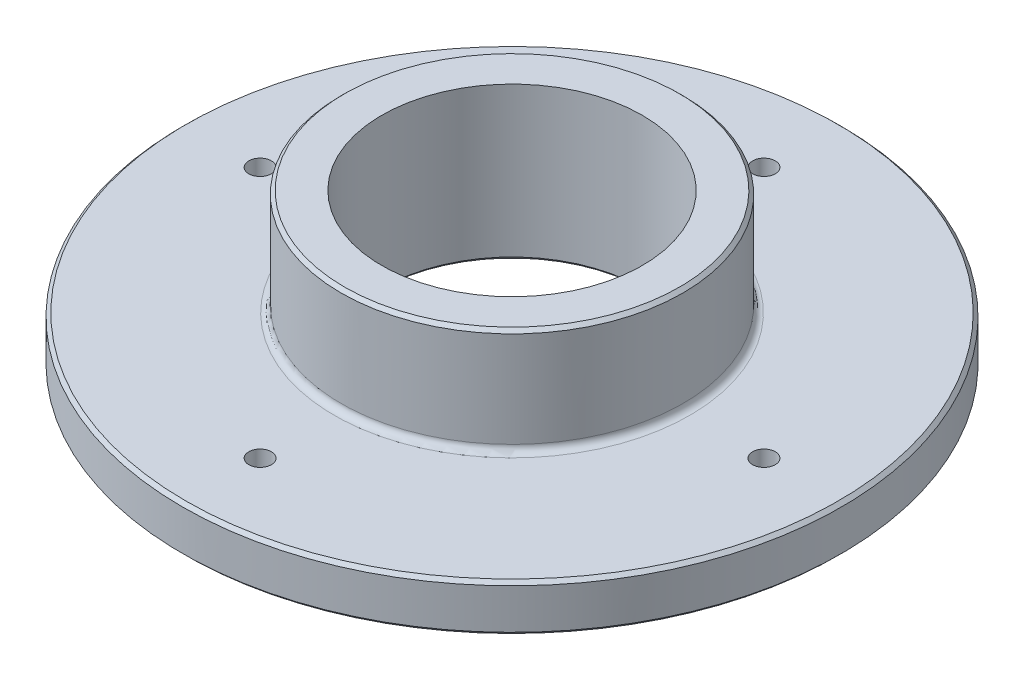
ISO-10303-21;
HEADER;
FILE_DESCRIPTION(('STEP AP214'),'2;1');
FILE_NAME('part.step','',(''),(''),'','','');
FILE_SCHEMA(('AUTOMOTIVE_DESIGN { 1 0 10303 214 1 1 1 1 }'));
ENDSEC;
DATA;
#1=APPLICATION_CONTEXT('core data for automotive mechanical design processes');
#2=APPLICATION_PROTOCOL_DEFINITION('international standard','automotive_design',2000,#1);
#3=PRODUCT_CONTEXT('',#1,'mechanical');
#4=PRODUCT('Part','Part','',(#3));
#5=PRODUCT_RELATED_PRODUCT_CATEGORY('part','',(#4));
#6=PRODUCT_DEFINITION_FORMATION('','',#4);
#7=PRODUCT_DEFINITION_CONTEXT('part definition',#1,'design');
#8=PRODUCT_DEFINITION('design','',#6,#7);
#9=PRODUCT_DEFINITION_SHAPE('','',#8);
#10=(LENGTH_UNIT() NAMED_UNIT(*) SI_UNIT(.MILLI.,.METRE.));
#11=(NAMED_UNIT(*) PLANE_ANGLE_UNIT() SI_UNIT($,.RADIAN.));
#12=(NAMED_UNIT(*) SI_UNIT($,.STERADIAN.) SOLID_ANGLE_UNIT());
#13=UNCERTAINTY_MEASURE_WITH_UNIT(LENGTH_MEASURE(1.E-05),#10,'distance_accuracy_value','');
#14=(GEOMETRIC_REPRESENTATION_CONTEXT(3) GLOBAL_UNCERTAINTY_ASSIGNED_CONTEXT((#13)) GLOBAL_UNIT_ASSIGNED_CONTEXT((#10,
#11,#12)) REPRESENTATION_CONTEXT('',''));
#15=CARTESIAN_POINT('',(0.,0.,0.));
#16=DIRECTION('',(0.,0.,1.));
#17=DIRECTION('',(1.,0.,0.));
#18=AXIS2_PLACEMENT_3D('',#15,#16,#17);
#19=CARTESIAN_POINT('',(38.1,0.,0.));
#20=DIRECTION('',(0.,-1.,0.));
#21=DIRECTION('',(0.,0.,-1.));
#22=AXIS2_PLACEMENT_3D('',#19,#20,#21);
#23=PLANE('',#22);
#24=CARTESIAN_POINT('',(73.7,0.,0.));
#25=DIRECTION('',(0.,-1.,0.));
#26=DIRECTION('',(0.,0.,-1.));
#27=AXIS2_PLACEMENT_3D('',#24,#25,#26);
#28=CIRCLE('',#27,3.29999999999999);
#29=CARTESIAN_POINT('',(73.7,0.,-3.29999999999999));
#30=VERTEX_POINT('',#29);
#31=EDGE_CURVE('E90',#30,#30,#28,.T.);
#32=ORIENTED_EDGE('',*,*,#31,.F.);
#33=EDGE_LOOP('',(#32));
#34=FACE_BOUND('',#33,.T.);
#35=CARTESIAN_POINT('',(0.,0.,73.7));
#36=DIRECTION('',(0.,-1.,0.));
#37=DIRECTION('',(0.,0.,-1.));
#38=AXIS2_PLACEMENT_3D('',#35,#36,#37);
#39=CIRCLE('',#38,3.29999999999999);
#40=CARTESIAN_POINT('',(0.,0.,70.4));
#41=VERTEX_POINT('',#40);
#42=EDGE_CURVE('E84',#41,#41,#39,.T.);
#43=ORIENTED_EDGE('',*,*,#42,.F.);
#44=EDGE_LOOP('',(#43));
#45=FACE_BOUND('',#44,.T.);
#46=CARTESIAN_POINT('',(-73.7,0.,0.));
#47=DIRECTION('',(0.,-1.,0.));
#48=DIRECTION('',(0.,0.,-1.));
#49=AXIS2_PLACEMENT_3D('',#46,#47,#48);
#50=CIRCLE('',#49,3.29999999999999);
#51=CARTESIAN_POINT('',(-73.7,0.,-3.30000000000003));
#52=VERTEX_POINT('',#51);
#53=EDGE_CURVE('E78',#52,#52,#50,.T.);
#54=ORIENTED_EDGE('',*,*,#53,.F.);
#55=EDGE_LOOP('',(#54));
#56=FACE_BOUND('',#55,.T.);
#57=CARTESIAN_POINT('',(0.,0.,-73.7000000000001));
#58=DIRECTION('',(0.,-1.,0.));
#59=DIRECTION('',(0.,0.,-1.));
#60=AXIS2_PLACEMENT_3D('',#57,#58,#59);
#61=CIRCLE('',#60,3.29999999999999);
#62=CARTESIAN_POINT('',(0.,0.,-77.0000000000001));
#63=VERTEX_POINT('',#62);
#64=EDGE_CURVE('E72',#63,#63,#61,.T.);
#65=ORIENTED_EDGE('',*,*,#64,.F.);
#66=EDGE_LOOP('',(#65));
#67=FACE_BOUND('',#66,.T.);
#68=CARTESIAN_POINT('',(0.,0.,0.));
#69=DIRECTION('',(0.,-1.,0.));
#70=DIRECTION('',(0.,0.,-1.));
#71=AXIS2_PLACEMENT_3D('',#68,#69,#70);
#72=CIRCLE('',#71,95.4);
#73=CARTESIAN_POINT('',(0.,0.,-95.4));
#74=VERTEX_POINT('',#73);
#75=EDGE_CURVE('E38',#74,#74,#72,.T.);
#76=ORIENTED_EDGE('',*,*,#75,.T.);
#77=EDGE_LOOP('',(#76));
#78=FACE_BOUND('',#77,.T.);
#79=CARTESIAN_POINT('',(0.,0.,0.));
#80=DIRECTION('',(0.,-1.,0.));
#81=DIRECTION('',(0.,0.,-1.));
#82=AXIS2_PLACEMENT_3D('',#79,#80,#81);
#83=CIRCLE('',#82,39.1);
#84=CARTESIAN_POINT('',(0.,0.,-39.1));
#85=VERTEX_POINT('',#84);
#86=EDGE_CURVE('E42',#85,#85,#83,.F.);
#87=ORIENTED_EDGE('',*,*,#86,.T.);
#88=EDGE_LOOP('',(#87));
#89=FACE_BOUND('',#88,.T.);
#90=ADVANCED_FACE('F31',(#34,#45,#56,#67,#78,#89),#23,.T.);
#91=CARTESIAN_POINT('',(0.,0.,0.));
#92=DIRECTION('',(0.,-1.,0.));
#93=DIRECTION('',(0.,0.,-1.));
#94=AXIS2_PLACEMENT_3D('',#91,#92,#93);
#95=CYLINDRICAL_SURFACE('',#94,38.1);
#96=CARTESIAN_POINT('',(0.,0.999999999999987,0.));
#97=DIRECTION('',(0.,-1.,0.));
#98=DIRECTION('',(0.,0.,-1.));
#99=AXIS2_PLACEMENT_3D('',#96,#97,#98);
#100=CIRCLE('',#99,38.1);
#101=CARTESIAN_POINT('',(0.,0.999999999999987,-38.1));
#102=VERTEX_POINT('',#101);
#103=EDGE_CURVE('E10',#102,#102,#100,.T.);
#104=ORIENTED_EDGE('',*,*,#103,.T.);
#105=EDGE_LOOP('',(#104));
#106=FACE_BOUND('',#105,.T.);
#107=CARTESIAN_POINT('',(0.,44.8,0.));
#108=DIRECTION('',(0.,-1.,0.));
#109=DIRECTION('',(0.,0.,-1.));
#110=AXIS2_PLACEMENT_3D('',#107,#108,#109);
#111=CIRCLE('',#110,38.1);
#112=CARTESIAN_POINT('',(0.,44.8,-38.1));
#113=VERTEX_POINT('',#112);
#114=EDGE_CURVE('E63',#113,#113,#111,.T.);
#115=ORIENTED_EDGE('',*,*,#114,.F.);
#116=EDGE_LOOP('',(#115));
#117=FACE_BOUND('',#116,.T.);
#118=ADVANCED_FACE('F127',(#106,#117),#95,.F.);
#119=CARTESIAN_POINT('',(50.,44.8,0.));
#120=DIRECTION('',(0.,1.,0.));
#121=DIRECTION('',(0.,0.,1.));
#122=AXIS2_PLACEMENT_3D('',#119,#120,#121);
#123=PLANE('',#122);
#124=CARTESIAN_POINT('',(0.,44.8,0.));
#125=DIRECTION('',(0.,1.,0.));
#126=DIRECTION('',(0.,0.,1.));
#127=AXIS2_PLACEMENT_3D('',#124,#125,#126);
#128=CIRCLE('',#127,48.9999999999999);
#129=CARTESIAN_POINT('',(0.,44.8,48.9999999999999));
#130=VERTEX_POINT('',#129);
#131=EDGE_CURVE('E57',#130,#130,#128,.T.);
#132=ORIENTED_EDGE('',*,*,#131,.T.);
#133=EDGE_LOOP('',(#132));
#134=FACE_BOUND('',#133,.T.);
#135=ORIENTED_EDGE('',*,*,#114,.T.);
#136=EDGE_LOOP('',(#135));
#137=FACE_BOUND('',#136,.T.);
#138=ADVANCED_FACE('F123',(#134,#137),#123,.T.);
#139=CARTESIAN_POINT('',(0.,0.,0.));
#140=DIRECTION('',(0.,-1.,0.));
#141=DIRECTION('',(0.,0.,-1.));
#142=AXIS2_PLACEMENT_3D('',#139,#140,#141);
#143=CYLINDRICAL_SURFACE('',#142,50.);
#144=CARTESIAN_POINT('',(0.,43.7999999999999,0.));
#145=DIRECTION('',(0.,1.,0.));
#146=DIRECTION('',(0.,0.,1.));
#147=AXIS2_PLACEMENT_3D('',#144,#145,#146);
#148=CIRCLE('',#147,50.);
#149=CARTESIAN_POINT('',(0.,43.7999999999999,50.));
#150=VERTEX_POINT('',#149);
#151=EDGE_CURVE('E60',#150,#150,#148,.F.);
#152=ORIENTED_EDGE('',*,*,#151,.T.);
#153=EDGE_LOOP('',(#152));
#154=FACE_BOUND('',#153,.T.);
#155=CARTESIAN_POINT('',(0.,15.8,0.));
#156=DIRECTION('',(0.,-1.,0.));
#157=DIRECTION('',(0.,0.,-1.));
#158=AXIS2_PLACEMENT_3D('',#155,#156,#157);
#159=CIRCLE('',#158,50.);
#160=CARTESIAN_POINT('',(0.,15.8,-50.));
#161=VERTEX_POINT('',#160);
#162=EDGE_CURVE('E66',#161,#161,#159,.T.);
#163=ORIENTED_EDGE('',*,*,#162,.F.);
#164=EDGE_LOOP('',(#163));
#165=FACE_BOUND('',#164,.T.);
#166=ADVANCED_FACE('F116',(#154,#165),#143,.T.);
#167=CARTESIAN_POINT('',(0.,15.8,0.));
#168=DIRECTION('',(0.,-1.,0.));
#169=DIRECTION('',(0.,0.,-1.));
#170=AXIS2_PLACEMENT_3D('',#167,#168,#169);
#171=TOROIDAL_SURFACE('',#170,52.,2.);
#172=ORIENTED_EDGE('',*,*,#162,.T.);
#173=EDGE_LOOP('',(#172));
#174=FACE_BOUND('',#173,.T.);
#175=CARTESIAN_POINT('',(0.,13.8,0.));
#176=DIRECTION('',(0.,-1.,0.));
#177=DIRECTION('',(0.,0.,-1.));
#178=AXIS2_PLACEMENT_3D('',#175,#176,#177);
#179=CIRCLE('',#178,52.);
#180=CARTESIAN_POINT('',(0.,13.8,-52.));
#181=VERTEX_POINT('',#180);
#182=EDGE_CURVE('E69',#181,#181,#179,.T.);
#183=ORIENTED_EDGE('',*,*,#182,.F.);
#184=EDGE_LOOP('',(#183));
#185=FACE_BOUND('',#184,.T.);
#186=ADVANCED_FACE('F103',(#174,#185),#171,.F.);
#187=CARTESIAN_POINT('',(96.4,13.8,0.));
#188=DIRECTION('',(0.,1.,0.));
#189=DIRECTION('',(0.,0.,1.));
#190=AXIS2_PLACEMENT_3D('',#187,#188,#189);
#191=PLANE('',#190);
#192=CARTESIAN_POINT('',(73.7,13.8,0.));
#193=DIRECTION('',(0.,1.,0.));
#194=DIRECTION('',(0.,0.,1.));
#195=AXIS2_PLACEMENT_3D('',#192,#193,#194);
#196=CIRCLE('',#195,3.29999999999998);
#197=CARTESIAN_POINT('',(73.7,13.8,3.29999999999998));
#198=VERTEX_POINT('',#197);
#199=EDGE_CURVE('E93',#198,#198,#196,.T.);
#200=ORIENTED_EDGE('',*,*,#199,.F.);
#201=EDGE_LOOP('',(#200));
#202=FACE_BOUND('',#201,.T.);
#203=CARTESIAN_POINT('',(0.,13.8,73.7));
#204=DIRECTION('',(0.,1.,0.));
#205=DIRECTION('',(0.,0.,1.));
#206=AXIS2_PLACEMENT_3D('',#203,#204,#205);
#207=CIRCLE('',#206,3.29999999999999);
#208=CARTESIAN_POINT('',(0.,13.8,77.));
#209=VERTEX_POINT('',#208);
#210=EDGE_CURVE('E87',#209,#209,#207,.T.);
#211=ORIENTED_EDGE('',*,*,#210,.F.);
#212=EDGE_LOOP('',(#211));
#213=FACE_BOUND('',#212,.T.);
#214=CARTESIAN_POINT('',(-73.7,13.8,0.));
#215=DIRECTION('',(0.,1.,0.));
#216=DIRECTION('',(0.,0.,1.));
#217=AXIS2_PLACEMENT_3D('',#214,#215,#216);
#218=CIRCLE('',#217,3.29999999999998);
#219=CARTESIAN_POINT('',(-73.7,13.8,3.29999999999995));
#220=VERTEX_POINT('',#219);
#221=EDGE_CURVE('E81',#220,#220,#218,.T.);
#222=ORIENTED_EDGE('',*,*,#221,.F.);
#223=EDGE_LOOP('',(#222));
#224=FACE_BOUND('',#223,.T.);
#225=CARTESIAN_POINT('',(0.,13.8,-73.7000000000001));
#226=DIRECTION('',(0.,1.,0.));
#227=DIRECTION('',(0.,0.,1.));
#228=AXIS2_PLACEMENT_3D('',#225,#226,#227);
#229=CIRCLE('',#228,3.29999999999999);
#230=CARTESIAN_POINT('',(0.,13.8,-70.4000000000001));
#231=VERTEX_POINT('',#230);
#232=EDGE_CURVE('E75',#231,#231,#229,.T.);
#233=ORIENTED_EDGE('',*,*,#232,.F.);
#234=EDGE_LOOP('',(#233));
#235=FACE_BOUND('',#234,.T.);
#236=CARTESIAN_POINT('',(0.,13.8,0.));
#237=DIRECTION('',(0.,1.,0.));
#238=DIRECTION('',(0.,0.,1.));
#239=AXIS2_PLACEMENT_3D('',#236,#237,#238);
#240=CIRCLE('',#239,95.4);
#241=CARTESIAN_POINT('',(0.,13.8,95.4));
#242=VERTEX_POINT('',#241);
#243=EDGE_CURVE('E46',#242,#242,#240,.T.);
#244=ORIENTED_EDGE('',*,*,#243,.T.);
#245=EDGE_LOOP('',(#244));
#246=FACE_BOUND('',#245,.T.);
#247=ORIENTED_EDGE('',*,*,#182,.T.);
#248=EDGE_LOOP('',(#247));
#249=FACE_BOUND('',#248,.T.);
#250=ADVANCED_FACE('F99',(#202,#213,#224,#235,#246,#249),#191,.T.);
#251=CARTESIAN_POINT('',(0.,0.,0.));
#252=DIRECTION('',(0.,-1.,0.));
#253=DIRECTION('',(0.,0.,-1.));
#254=AXIS2_PLACEMENT_3D('',#251,#252,#253);
#255=CYLINDRICAL_SURFACE('',#254,96.4);
#256=CARTESIAN_POINT('',(0.,12.8,0.));
#257=DIRECTION('',(0.,1.,0.));
#258=DIRECTION('',(0.,0.,1.));
#259=AXIS2_PLACEMENT_3D('',#256,#257,#258);
#260=CIRCLE('',#259,96.4);
#261=CARTESIAN_POINT('',(0.,12.8,96.4));
#262=VERTEX_POINT('',#261);
#263=EDGE_CURVE('E51',#262,#262,#260,.F.);
#264=ORIENTED_EDGE('',*,*,#263,.T.);
#265=EDGE_LOOP('',(#264));
#266=FACE_BOUND('',#265,.T.);
#267=CARTESIAN_POINT('',(0.,0.999999999999959,0.));
#268=DIRECTION('',(0.,-1.,0.));
#269=DIRECTION('',(0.,0.,-1.));
#270=AXIS2_PLACEMENT_3D('',#267,#268,#269);
#271=CIRCLE('',#270,96.4);
#272=CARTESIAN_POINT('',(0.,0.999999999999959,-96.4));
#273=VERTEX_POINT('',#272);
#274=EDGE_CURVE('E54',#273,#273,#271,.F.);
#275=ORIENTED_EDGE('',*,*,#274,.T.);
#276=EDGE_LOOP('',(#275));
#277=FACE_BOUND('',#276,.T.);
#278=ADVANCED_FACE('F102',(#266,#277),#255,.T.);
#279=CARTESIAN_POINT('',(0.,43.7999999999999,0.));
#280=DIRECTION('',(0.,-1.,0.));
#281=DIRECTION('',(0.,0.,-1.));
#282=AXIS2_PLACEMENT_3D('',#279,#280,#281);
#283=CONICAL_SURFACE('',#282,50.,0.785398163397445);
#284=ORIENTED_EDGE('',*,*,#131,.F.);
#285=EDGE_LOOP('',(#284));
#286=FACE_BOUND('',#285,.T.);
#287=ORIENTED_EDGE('',*,*,#151,.F.);
#288=EDGE_LOOP('',(#287));
#289=FACE_BOUND('',#288,.T.);
#290=ADVANCED_FACE('F139',(#286,#289),#283,.T.);
#291=CARTESIAN_POINT('',(0.,12.8,0.));
#292=DIRECTION('',(0.,-1.,0.));
#293=DIRECTION('',(0.,0.,-1.));
#294=AXIS2_PLACEMENT_3D('',#291,#292,#293);
#295=CONICAL_SURFACE('',#294,96.4,0.785398163397448);
#296=ORIENTED_EDGE('',*,*,#243,.F.);
#297=EDGE_LOOP('',(#296));
#298=FACE_BOUND('',#297,.T.);
#299=ORIENTED_EDGE('',*,*,#263,.F.);
#300=EDGE_LOOP('',(#299));
#301=FACE_BOUND('',#300,.T.);
#302=ADVANCED_FACE('F142',(#298,#301),#295,.T.);
#303=CARTESIAN_POINT('',(0.,0.,0.));
#304=DIRECTION('',(0.,1.,0.));
#305=DIRECTION('',(0.,0.,1.));
#306=AXIS2_PLACEMENT_3D('',#303,#304,#305);
#307=CONICAL_SURFACE('',#306,95.4,0.785398163397448);
#308=ORIENTED_EDGE('',*,*,#274,.F.);
#309=EDGE_LOOP('',(#308));
#310=FACE_BOUND('',#309,.T.);
#311=ORIENTED_EDGE('',*,*,#75,.F.);
#312=EDGE_LOOP('',(#311));
#313=FACE_BOUND('',#312,.T.);
#314=ADVANCED_FACE('F145',(#310,#313),#307,.T.);
#315=CARTESIAN_POINT('',(0.,0.999999999999987,0.));
#316=DIRECTION('',(0.,-1.,0.));
#317=DIRECTION('',(0.,0.,-1.));
#318=AXIS2_PLACEMENT_3D('',#315,#316,#317);
#319=CONICAL_SURFACE('',#318,38.1,0.785398163397448);
#320=ORIENTED_EDGE('',*,*,#86,.F.);
#321=EDGE_LOOP('',(#320));
#322=FACE_BOUND('',#321,.T.);
#323=ORIENTED_EDGE('',*,*,#103,.F.);
#324=EDGE_LOOP('',(#323));
#325=FACE_BOUND('',#324,.T.);
#326=ADVANCED_FACE('F33',(#322,#325),#319,.F.);
#327=CARTESIAN_POINT('',(0.,13.8,-73.7000000000001));
#328=DIRECTION('',(0.,1.,0.));
#329=DIRECTION('',(0.,0.,1.));
#330=AXIS2_PLACEMENT_3D('',#327,#328,#329);
#331=CYLINDRICAL_SURFACE('',#330,3.29999999999999);
#332=ORIENTED_EDGE('',*,*,#64,.T.);
#333=EDGE_LOOP('',(#332));
#334=FACE_BOUND('',#333,.T.);
#335=ORIENTED_EDGE('',*,*,#232,.T.);
#336=EDGE_LOOP('',(#335));
#337=FACE_BOUND('',#336,.T.);
#338=ADVANCED_FACE('F152',(#334,#337),#331,.F.);
#339=CARTESIAN_POINT('',(-73.7,13.8,0.));
#340=DIRECTION('',(0.,1.,0.));
#341=DIRECTION('',(0.,0.,1.));
#342=AXIS2_PLACEMENT_3D('',#339,#340,#341);
#343=CYLINDRICAL_SURFACE('',#342,3.29999999999999);
#344=ORIENTED_EDGE('',*,*,#53,.T.);
#345=EDGE_LOOP('',(#344));
#346=FACE_BOUND('',#345,.T.);
#347=ORIENTED_EDGE('',*,*,#221,.T.);
#348=EDGE_LOOP('',(#347));
#349=FACE_BOUND('',#348,.T.);
#350=ADVANCED_FACE('F165',(#346,#349),#343,.F.);
#351=CARTESIAN_POINT('',(0.,13.8,73.7));
#352=DIRECTION('',(0.,1.,0.));
#353=DIRECTION('',(0.,0.,1.));
#354=AXIS2_PLACEMENT_3D('',#351,#352,#353);
#355=CYLINDRICAL_SURFACE('',#354,3.29999999999999);
#356=ORIENTED_EDGE('',*,*,#42,.T.);
#357=EDGE_LOOP('',(#356));
#358=FACE_BOUND('',#357,.T.);
#359=ORIENTED_EDGE('',*,*,#210,.T.);
#360=EDGE_LOOP('',(#359));
#361=FACE_BOUND('',#360,.T.);
#362=ADVANCED_FACE('F169',(#358,#361),#355,.F.);
#363=CARTESIAN_POINT('',(73.7,13.8,0.));
#364=DIRECTION('',(0.,1.,0.));
#365=DIRECTION('',(0.,0.,1.));
#366=AXIS2_PLACEMENT_3D('',#363,#364,#365);
#367=CYLINDRICAL_SURFACE('',#366,3.29999999999999);
#368=ORIENTED_EDGE('',*,*,#31,.T.);
#369=EDGE_LOOP('',(#368));
#370=FACE_BOUND('',#369,.T.);
#371=ORIENTED_EDGE('',*,*,#199,.T.);
#372=EDGE_LOOP('',(#371));
#373=FACE_BOUND('',#372,.T.);
#374=ADVANCED_FACE('F97',(#370,#373),#367,.F.);
#375=CLOSED_SHELL('',(#90,#118,#138,#166,#186,#250,#278,#290,#302,#314,#326,#338,#350,#362,#374));
#376=MANIFOLD_SOLID_BREP('B2',#375);
#377=ADVANCED_BREP_SHAPE_REPRESENTATION('',(#18,#376),#14);
#378=SHAPE_DEFINITION_REPRESENTATION(#9,#377);
ENDSEC;
END-ISO-10303-21;
